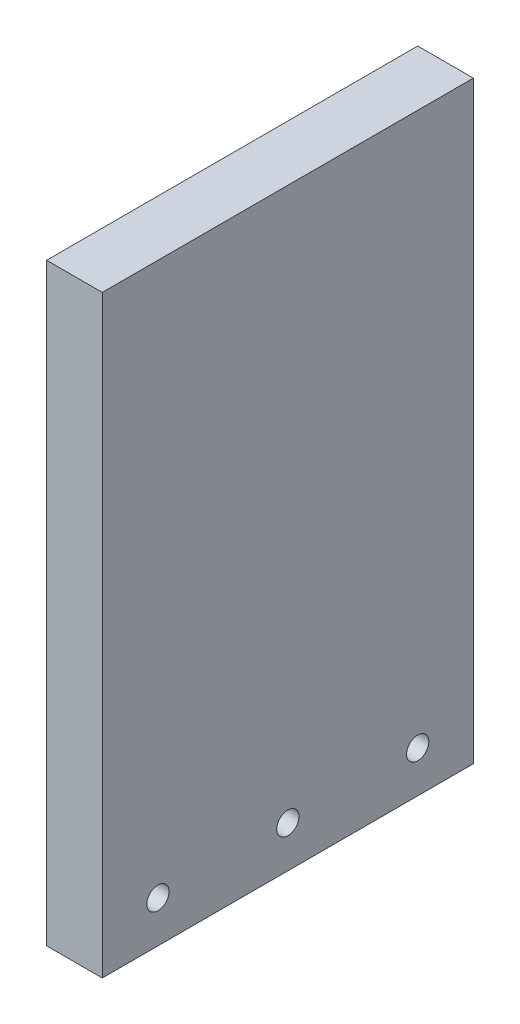
ISO-10303-21;
HEADER;
FILE_DESCRIPTION(('STEP AP214'),'2;1');
FILE_NAME('part.step','',(''),(''),'','','');
FILE_SCHEMA(('AUTOMOTIVE_DESIGN { 1 0 10303 214 1 1 1 1 }'));
ENDSEC;
DATA;
#1=APPLICATION_CONTEXT('core data for automotive mechanical design processes');
#2=APPLICATION_PROTOCOL_DEFINITION('international standard','automotive_design',2000,#1);
#3=PRODUCT_CONTEXT('',#1,'mechanical');
#4=PRODUCT('Part','Part','',(#3));
#5=PRODUCT_RELATED_PRODUCT_CATEGORY('part','',(#4));
#6=PRODUCT_DEFINITION_FORMATION('','',#4);
#7=PRODUCT_DEFINITION_CONTEXT('part definition',#1,'design');
#8=PRODUCT_DEFINITION('design','',#6,#7);
#9=PRODUCT_DEFINITION_SHAPE('','',#8);
#10=(LENGTH_UNIT() NAMED_UNIT(*) SI_UNIT(.MILLI.,.METRE.));
#11=(NAMED_UNIT(*) PLANE_ANGLE_UNIT() SI_UNIT($,.RADIAN.));
#12=(NAMED_UNIT(*) SI_UNIT($,.STERADIAN.) SOLID_ANGLE_UNIT());
#13=UNCERTAINTY_MEASURE_WITH_UNIT(LENGTH_MEASURE(1.E-05),#10,'distance_accuracy_value','');
#14=(GEOMETRIC_REPRESENTATION_CONTEXT(3) GLOBAL_UNCERTAINTY_ASSIGNED_CONTEXT((#13)) GLOBAL_UNIT_ASSIGNED_CONTEXT((#10,
#11,#12)) REPRESENTATION_CONTEXT('',''));
#15=CARTESIAN_POINT('',(0.,0.,0.));
#16=DIRECTION('',(0.,0.,1.));
#17=DIRECTION('',(1.,0.,0.));
#18=AXIS2_PLACEMENT_3D('',#15,#16,#17);
#19=CARTESIAN_POINT('',(0.,203.2,0.));
#20=DIRECTION('',(1.,0.,0.));
#21=DIRECTION('',(0.,0.,-1.));
#22=AXIS2_PLACEMENT_3D('',#19,#20,#21);
#23=PLANE('',#22);
#24=CARTESIAN_POINT('',(0.,14.224,-107.95));
#25=DIRECTION('',(-1.,0.,0.));
#26=DIRECTION('',(0.,0.,1.));
#27=AXIS2_PLACEMENT_3D('',#24,#25,#26);
#28=CIRCLE('',#27,3.81);
#29=CARTESIAN_POINT('',(0.,14.224,-104.14));
#30=VERTEX_POINT('',#29);
#31=EDGE_CURVE('E109',#30,#30,#28,.T.);
#32=ORIENTED_EDGE('',*,*,#31,.F.);
#33=EDGE_LOOP('',(#32));
#34=FACE_BOUND('',#33,.T.);
#35=CARTESIAN_POINT('',(0.,14.224,-63.5));
#36=DIRECTION('',(-1.,0.,0.));
#37=DIRECTION('',(0.,0.,1.));
#38=AXIS2_PLACEMENT_3D('',#35,#36,#37);
#39=CIRCLE('',#38,3.81);
#40=CARTESIAN_POINT('',(0.,14.224,-59.69));
#41=VERTEX_POINT('',#40);
#42=EDGE_CURVE('E139',#41,#41,#39,.T.);
#43=ORIENTED_EDGE('',*,*,#42,.F.);
#44=EDGE_LOOP('',(#43));
#45=FACE_BOUND('',#44,.T.);
#46=CARTESIAN_POINT('',(0.,14.224,-19.05));
#47=DIRECTION('',(-1.,0.,0.));
#48=DIRECTION('',(0.,0.,1.));
#49=AXIS2_PLACEMENT_3D('',#46,#47,#48);
#50=CIRCLE('',#49,3.81);
#51=CARTESIAN_POINT('',(0.,14.224,-15.24));
#52=VERTEX_POINT('',#51);
#53=EDGE_CURVE('E143',#52,#52,#50,.T.);
#54=ORIENTED_EDGE('',*,*,#53,.F.);
#55=EDGE_LOOP('',(#54));
#56=FACE_BOUND('',#55,.T.);
#57=DIRECTION('',(0.,0.,1.));
#58=VECTOR('',#57,1.);
#59=CARTESIAN_POINT('',(0.,0.,0.));
#60=LINE('',#59,#58);
#61=CARTESIAN_POINT('',(0.,0.,-127.));
#62=VERTEX_POINT('',#61);
#63=CARTESIAN_POINT('',(0.,0.,0.));
#64=VERTEX_POINT('',#63);
#65=EDGE_CURVE('E98',#62,#64,#60,.T.);
#66=ORIENTED_EDGE('',*,*,#65,.T.);
#67=DIRECTION('',(0.,-1.,0.));
#68=VECTOR('',#67,1.);
#69=CARTESIAN_POINT('',(0.,203.2,0.));
#70=LINE('',#69,#68);
#71=CARTESIAN_POINT('',(0.,203.2,0.));
#72=VERTEX_POINT('',#71);
#73=EDGE_CURVE('E11',#72,#64,#70,.T.);
#74=ORIENTED_EDGE('',*,*,#73,.F.);
#75=DIRECTION('',(0.,0.,1.));
#76=VECTOR('',#75,1.);
#77=CARTESIAN_POINT('',(0.,203.2,0.));
#78=LINE('',#77,#76);
#79=CARTESIAN_POINT('',(0.,203.2,-127.));
#80=VERTEX_POINT('',#79);
#81=EDGE_CURVE('E85',#80,#72,#78,.T.);
#82=ORIENTED_EDGE('',*,*,#81,.F.);
#83=DIRECTION('',(0.,-1.,0.));
#84=VECTOR('',#83,1.);
#85=CARTESIAN_POINT('',(0.,203.2,-127.));
#86=LINE('',#85,#84);
#87=EDGE_CURVE('E94',#80,#62,#86,.T.);
#88=ORIENTED_EDGE('',*,*,#87,.T.);
#89=EDGE_LOOP('',(#66,#74,#82,#88));
#90=FACE_BOUND('',#89,.T.);
#91=ADVANCED_FACE('F32',(#34,#45,#56,#90),#23,.F.);
#92=CARTESIAN_POINT('',(0.,203.2,0.));
#93=DIRECTION('',(0.,0.,-1.));
#94=DIRECTION('',(-1.,0.,0.));
#95=AXIS2_PLACEMENT_3D('',#92,#93,#94);
#96=PLANE('',#95);
#97=DIRECTION('',(1.,0.,0.));
#98=VECTOR('',#97,1.);
#99=CARTESIAN_POINT('',(0.,0.,0.));
#100=LINE('',#99,#98);
#101=CARTESIAN_POINT('',(19.05,0.,0.));
#102=VERTEX_POINT('',#101);
#103=EDGE_CURVE('E89',#64,#102,#100,.T.);
#104=ORIENTED_EDGE('',*,*,#103,.T.);
#105=DIRECTION('',(0.,-1.,0.));
#106=VECTOR('',#105,1.);
#107=CARTESIAN_POINT('',(19.05,203.2,0.));
#108=LINE('',#107,#106);
#109=CARTESIAN_POINT('',(19.05,203.2,0.));
#110=VERTEX_POINT('',#109);
#111=EDGE_CURVE('E41',#110,#102,#108,.T.);
#112=ORIENTED_EDGE('',*,*,#111,.F.);
#113=DIRECTION('',(1.,0.,0.));
#114=VECTOR('',#113,1.);
#115=CARTESIAN_POINT('',(0.,203.2,0.));
#116=LINE('',#115,#114);
#117=EDGE_CURVE('E80',#72,#110,#116,.T.);
#118=ORIENTED_EDGE('',*,*,#117,.F.);
#119=ORIENTED_EDGE('',*,*,#73,.T.);
#120=EDGE_LOOP('',(#104,#112,#118,#119));
#121=FACE_BOUND('',#120,.T.);
#122=ADVANCED_FACE('F88',(#121),#96,.F.);
#123=CARTESIAN_POINT('',(19.05,203.2,0.));
#124=DIRECTION('',(-1.,0.,0.));
#125=DIRECTION('',(0.,0.,1.));
#126=AXIS2_PLACEMENT_3D('',#123,#124,#125);
#127=PLANE('',#126);
#128=CARTESIAN_POINT('',(19.05,14.224,-107.95));
#129=DIRECTION('',(-1.,0.,0.));
#130=DIRECTION('',(0.,0.,1.));
#131=AXIS2_PLACEMENT_3D('',#128,#129,#130);
#132=CIRCLE('',#131,3.81);
#133=CARTESIAN_POINT('',(19.05,14.224,-104.14));
#134=VERTEX_POINT('',#133);
#135=EDGE_CURVE('E35',#134,#134,#132,.T.);
#136=ORIENTED_EDGE('',*,*,#135,.T.);
#137=EDGE_LOOP('',(#136));
#138=FACE_BOUND('',#137,.T.);
#139=CARTESIAN_POINT('',(19.05,14.224,-63.5));
#140=DIRECTION('',(-1.,0.,0.));
#141=DIRECTION('',(0.,0.,1.));
#142=AXIS2_PLACEMENT_3D('',#139,#140,#141);
#143=CIRCLE('',#142,3.81);
#144=CARTESIAN_POINT('',(19.05,14.224,-59.69));
#145=VERTEX_POINT('',#144);
#146=EDGE_CURVE('E108',#145,#145,#143,.T.);
#147=ORIENTED_EDGE('',*,*,#146,.T.);
#148=EDGE_LOOP('',(#147));
#149=FACE_BOUND('',#148,.T.);
#150=CARTESIAN_POINT('',(19.05,14.224,-19.05));
#151=DIRECTION('',(-1.,0.,0.));
#152=DIRECTION('',(0.,0.,1.));
#153=AXIS2_PLACEMENT_3D('',#150,#151,#152);
#154=CIRCLE('',#153,3.81);
#155=CARTESIAN_POINT('',(19.05,14.224,-15.24));
#156=VERTEX_POINT('',#155);
#157=EDGE_CURVE('E106',#156,#156,#154,.T.);
#158=ORIENTED_EDGE('',*,*,#157,.T.);
#159=EDGE_LOOP('',(#158));
#160=FACE_BOUND('',#159,.T.);
#161=DIRECTION('',(0.,0.,-1.));
#162=VECTOR('',#161,1.);
#163=CARTESIAN_POINT('',(19.05,0.,0.));
#164=LINE('',#163,#162);
#165=CARTESIAN_POINT('',(19.05,0.,-127.));
#166=VERTEX_POINT('',#165);
#167=EDGE_CURVE('E67',#102,#166,#164,.T.);
#168=ORIENTED_EDGE('',*,*,#167,.T.);
#169=DIRECTION('',(0.,-1.,0.));
#170=VECTOR('',#169,1.);
#171=CARTESIAN_POINT('',(19.05,203.2,-127.));
#172=LINE('',#171,#170);
#173=CARTESIAN_POINT('',(19.05,203.2,-127.));
#174=VERTEX_POINT('',#173);
#175=EDGE_CURVE('E90',#174,#166,#172,.T.);
#176=ORIENTED_EDGE('',*,*,#175,.F.);
#177=DIRECTION('',(0.,0.,-1.));
#178=VECTOR('',#177,1.);
#179=CARTESIAN_POINT('',(19.05,203.2,0.));
#180=LINE('',#179,#178);
#181=EDGE_CURVE('E83',#110,#174,#180,.T.);
#182=ORIENTED_EDGE('',*,*,#181,.F.);
#183=ORIENTED_EDGE('',*,*,#111,.T.);
#184=EDGE_LOOP('',(#168,#176,#182,#183));
#185=FACE_BOUND('',#184,.T.);
#186=ADVANCED_FACE('F92',(#138,#149,#160,#185),#127,.F.);
#187=CARTESIAN_POINT('',(0.,203.2,-127.));
#188=DIRECTION('',(0.,0.,1.));
#189=DIRECTION('',(1.,0.,0.));
#190=AXIS2_PLACEMENT_3D('',#187,#188,#189);
#191=PLANE('',#190);
#192=DIRECTION('',(-1.,0.,0.));
#193=VECTOR('',#192,1.);
#194=CARTESIAN_POINT('',(0.,0.,-127.));
#195=LINE('',#194,#193);
#196=EDGE_CURVE('E73',#166,#62,#195,.T.);
#197=ORIENTED_EDGE('',*,*,#196,.T.);
#198=ORIENTED_EDGE('',*,*,#87,.F.);
#199=DIRECTION('',(-1.,0.,0.));
#200=VECTOR('',#199,1.);
#201=CARTESIAN_POINT('',(0.,203.2,-127.));
#202=LINE('',#201,#200);
#203=EDGE_CURVE('E50',#174,#80,#202,.T.);
#204=ORIENTED_EDGE('',*,*,#203,.F.);
#205=ORIENTED_EDGE('',*,*,#175,.T.);
#206=EDGE_LOOP('',(#197,#198,#204,#205));
#207=FACE_BOUND('',#206,.T.);
#208=ADVANCED_FACE('F155',(#207),#191,.F.);
#209=CARTESIAN_POINT('',(0.,203.2,0.));
#210=DIRECTION('',(0.,-1.,0.));
#211=DIRECTION('',(0.,0.,-1.));
#212=AXIS2_PLACEMENT_3D('',#209,#210,#211);
#213=PLANE('',#212);
#214=ORIENTED_EDGE('',*,*,#81,.T.);
#215=ORIENTED_EDGE('',*,*,#117,.T.);
#216=ORIENTED_EDGE('',*,*,#181,.T.);
#217=ORIENTED_EDGE('',*,*,#203,.T.);
#218=EDGE_LOOP('',(#214,#215,#216,#217));
#219=FACE_BOUND('',#218,.T.);
#220=ADVANCED_FACE('F81',(#219),#213,.F.);
#221=CARTESIAN_POINT('',(0.,0.,0.));
#222=DIRECTION('',(0.,-1.,0.));
#223=DIRECTION('',(0.,0.,-1.));
#224=AXIS2_PLACEMENT_3D('',#221,#222,#223);
#225=PLANE('',#224);
#226=ORIENTED_EDGE('',*,*,#65,.F.);
#227=ORIENTED_EDGE('',*,*,#196,.F.);
#228=ORIENTED_EDGE('',*,*,#167,.F.);
#229=ORIENTED_EDGE('',*,*,#103,.F.);
#230=EDGE_LOOP('',(#226,#227,#228,#229));
#231=FACE_BOUND('',#230,.T.);
#232=ADVANCED_FACE('F146',(#231),#225,.T.);
#233=CARTESIAN_POINT('',(88.138,14.224,-19.05));
#234=DIRECTION('',(-1.,0.,0.));
#235=DIRECTION('',(0.,0.,1.));
#236=AXIS2_PLACEMENT_3D('',#233,#234,#235);
#237=CYLINDRICAL_SURFACE('',#236,3.81);
#238=ORIENTED_EDGE('',*,*,#53,.T.);
#239=EDGE_LOOP('',(#238));
#240=FACE_BOUND('',#239,.T.);
#241=ORIENTED_EDGE('',*,*,#157,.F.);
#242=EDGE_LOOP('',(#241));
#243=FACE_BOUND('',#242,.T.);
#244=ADVANCED_FACE('F125',(#240,#243),#237,.F.);
#245=CARTESIAN_POINT('',(88.138,14.224,-63.5));
#246=DIRECTION('',(-1.,0.,0.));
#247=DIRECTION('',(0.,0.,1.));
#248=AXIS2_PLACEMENT_3D('',#245,#246,#247);
#249=CYLINDRICAL_SURFACE('',#248,3.81);
#250=ORIENTED_EDGE('',*,*,#42,.T.);
#251=EDGE_LOOP('',(#250));
#252=FACE_BOUND('',#251,.T.);
#253=ORIENTED_EDGE('',*,*,#146,.F.);
#254=EDGE_LOOP('',(#253));
#255=FACE_BOUND('',#254,.T.);
#256=ADVANCED_FACE('F119',(#252,#255),#249,.F.);
#257=CARTESIAN_POINT('',(88.138,14.224,-107.95));
#258=DIRECTION('',(-1.,0.,0.));
#259=DIRECTION('',(0.,0.,1.));
#260=AXIS2_PLACEMENT_3D('',#257,#258,#259);
#261=CYLINDRICAL_SURFACE('',#260,3.81);
#262=ORIENTED_EDGE('',*,*,#31,.T.);
#263=EDGE_LOOP('',(#262));
#264=FACE_BOUND('',#263,.T.);
#265=ORIENTED_EDGE('',*,*,#135,.F.);
#266=EDGE_LOOP('',(#265));
#267=FACE_BOUND('',#266,.T.);
#268=ADVANCED_FACE('F117',(#264,#267),#261,.F.);
#269=CLOSED_SHELL('',(#91,#122,#186,#208,#220,#232,#244,#256,#268));
#270=MANIFOLD_SOLID_BREP('B2',#269);
#271=ADVANCED_BREP_SHAPE_REPRESENTATION('',(#18,#270),#14);
#272=SHAPE_DEFINITION_REPRESENTATION(#9,#271);
ENDSEC;
END-ISO-10303-21;
